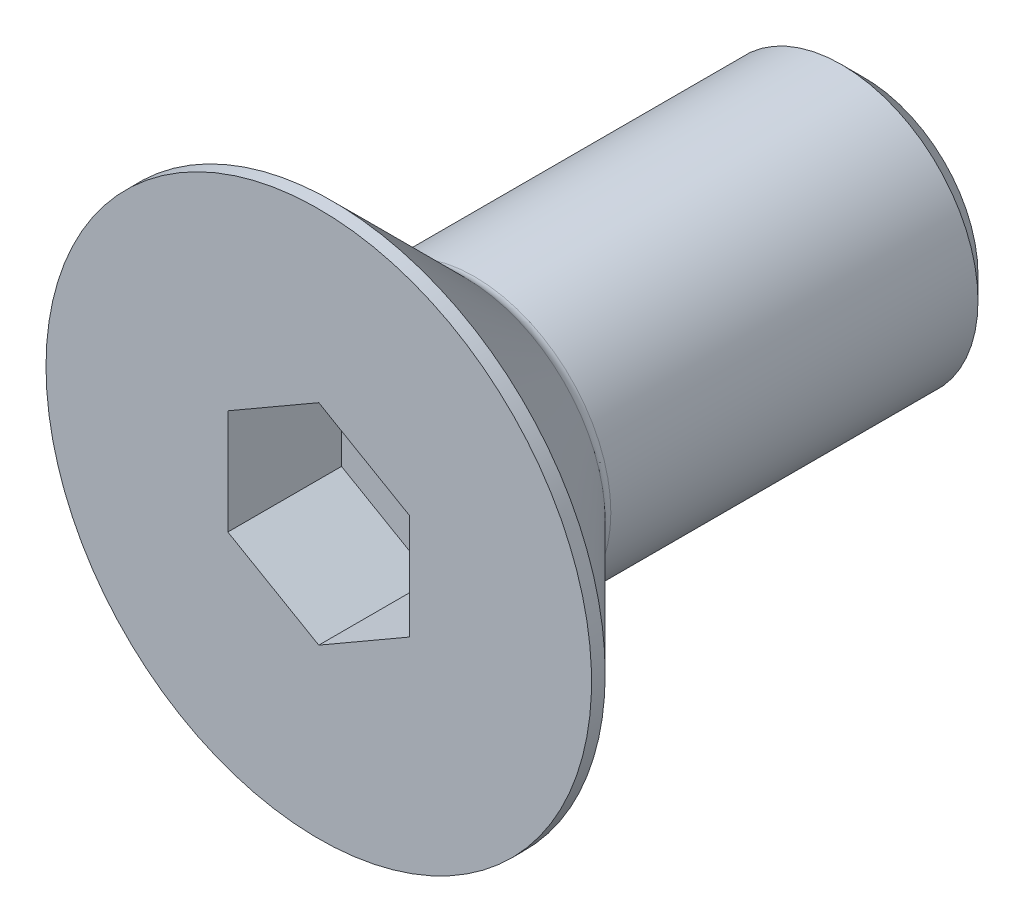
ISO-10303-21;
HEADER;
FILE_DESCRIPTION(('STEP AP214'),'2;1');
FILE_NAME('part.step','',(''),(''),'','','');
FILE_SCHEMA(('AUTOMOTIVE_DESIGN { 1 0 10303 214 1 1 1 1 }'));
ENDSEC;
DATA;
#1=APPLICATION_CONTEXT('core data for automotive mechanical design processes');
#2=APPLICATION_PROTOCOL_DEFINITION('international standard','automotive_design',2000,#1);
#3=PRODUCT_CONTEXT('',#1,'mechanical');
#4=PRODUCT('Part','Part','',(#3));
#5=PRODUCT_RELATED_PRODUCT_CATEGORY('part','',(#4));
#6=PRODUCT_DEFINITION_FORMATION('','',#4);
#7=PRODUCT_DEFINITION_CONTEXT('part definition',#1,'design');
#8=PRODUCT_DEFINITION('design','',#6,#7);
#9=PRODUCT_DEFINITION_SHAPE('','',#8);
#10=(LENGTH_UNIT() NAMED_UNIT(*) SI_UNIT(.MILLI.,.METRE.));
#11=(NAMED_UNIT(*) PLANE_ANGLE_UNIT() SI_UNIT($,.RADIAN.));
#12=(NAMED_UNIT(*) SI_UNIT($,.STERADIAN.) SOLID_ANGLE_UNIT());
#13=UNCERTAINTY_MEASURE_WITH_UNIT(LENGTH_MEASURE(1.E-05),#10,'distance_accuracy_value','');
#14=(GEOMETRIC_REPRESENTATION_CONTEXT(3) GLOBAL_UNCERTAINTY_ASSIGNED_CONTEXT((#13)) GLOBAL_UNIT_ASSIGNED_CONTEXT((#10,
#11,#12)) REPRESENTATION_CONTEXT('',''));
#15=CARTESIAN_POINT('',(0.,0.,0.));
#16=DIRECTION('',(0.,0.,1.));
#17=DIRECTION('',(1.,0.,0.));
#18=AXIS2_PLACEMENT_3D('',#15,#16,#17);
#19=CARTESIAN_POINT('',(0.,0.,-2.5));
#20=DIRECTION('',(0.,0.,1.));
#21=DIRECTION('',(1.,0.,0.));
#22=AXIS2_PLACEMENT_3D('',#19,#20,#21);
#23=PLANE('',#22);
#24=DIRECTION('',(-0.866025403784439,-0.5,0.));
#25=VECTOR('',#24,1.);
#26=CARTESIAN_POINT('',(0.,2.3094010767585,-2.5));
#27=LINE('',#26,#25);
#28=CARTESIAN_POINT('',(0.,2.3094010767585,-2.5));
#29=VERTEX_POINT('',#28);
#30=CARTESIAN_POINT('',(-2.,1.15470053837925,-2.5));
#31=VERTEX_POINT('',#30);
#32=EDGE_CURVE('E81',#29,#31,#27,.T.);
#33=ORIENTED_EDGE('',*,*,#32,.T.);
#34=DIRECTION('',(0.,1.,0.));
#35=VECTOR('',#34,1.);
#36=CARTESIAN_POINT('',(-2.,1.15470053837925,-2.5));
#37=LINE('',#36,#35);
#38=CARTESIAN_POINT('',(-2.,-1.15470053837925,-2.5));
#39=VERTEX_POINT('',#38);
#40=EDGE_CURVE('E65',#31,#39,#37,.F.);
#41=ORIENTED_EDGE('',*,*,#40,.T.);
#42=DIRECTION('',(0.866025403784439,-0.499999999999999,0.));
#43=VECTOR('',#42,1.);
#44=CARTESIAN_POINT('',(-2.,-1.15470053837925,-2.5));
#45=LINE('',#44,#43);
#46=CARTESIAN_POINT('',(0.,-2.3094010767585,-2.5));
#47=VERTEX_POINT('',#46);
#48=EDGE_CURVE('E70',#39,#47,#45,.T.);
#49=ORIENTED_EDGE('',*,*,#48,.T.);
#50=DIRECTION('',(0.866025403784439,0.5,0.));
#51=VECTOR('',#50,1.);
#52=CARTESIAN_POINT('',(0.,-2.3094010767585,-2.5));
#53=LINE('',#52,#51);
#54=CARTESIAN_POINT('',(2.,-1.15470053837925,-2.5));
#55=VERTEX_POINT('',#54);
#56=EDGE_CURVE('E127',#47,#55,#53,.T.);
#57=ORIENTED_EDGE('',*,*,#56,.T.);
#58=DIRECTION('',(0.,1.,0.));
#59=VECTOR('',#58,1.);
#60=CARTESIAN_POINT('',(2.,-1.15470053837925,-2.5));
#61=LINE('',#60,#59);
#62=CARTESIAN_POINT('',(2.,1.15470053837925,-2.5));
#63=VERTEX_POINT('',#62);
#64=EDGE_CURVE('E131',#55,#63,#61,.T.);
#65=ORIENTED_EDGE('',*,*,#64,.T.);
#66=DIRECTION('',(-0.866025403784439,0.499999999999999,0.));
#67=VECTOR('',#66,1.);
#68=CARTESIAN_POINT('',(2.,1.15470053837925,-2.5));
#69=LINE('',#68,#67);
#70=EDGE_CURVE('E136',#63,#29,#69,.T.);
#71=ORIENTED_EDGE('',*,*,#70,.T.);
#72=EDGE_LOOP('',(#33,#41,#49,#57,#65,#71));
#73=FACE_BOUND('',#72,.T.);
#74=ADVANCED_FACE('F14',(#73),#23,.T.);
#75=CARTESIAN_POINT('',(-2.,-1.15470053837925,0.));
#76=DIRECTION('',(-0.499999999999999,-0.866025403784439,0.));
#77=DIRECTION('',(0.866025403784439,-0.499999999999999,0.));
#78=AXIS2_PLACEMENT_3D('',#75,#76,#77);
#79=PLANE('',#78);
#80=DIRECTION('',(0.,0.,1.));
#81=VECTOR('',#80,1.);
#82=CARTESIAN_POINT('',(-2.,-1.15470053837925,0.));
#83=LINE('',#82,#81);
#84=CARTESIAN_POINT('',(-2.,-1.15470053837925,0.));
#85=VERTEX_POINT('',#84);
#86=EDGE_CURVE('E72',#39,#85,#83,.T.);
#87=ORIENTED_EDGE('',*,*,#86,.T.);
#88=DIRECTION('',(-0.866025403784439,0.499999999999999,0.));
#89=VECTOR('',#88,1.);
#90=CARTESIAN_POINT('',(0.,-2.3094010767585,0.));
#91=LINE('',#90,#89);
#92=CARTESIAN_POINT('',(0.,-2.3094010767585,0.));
#93=VERTEX_POINT('',#92);
#94=EDGE_CURVE('E125',#93,#85,#91,.T.);
#95=ORIENTED_EDGE('',*,*,#94,.F.);
#96=DIRECTION('',(0.,0.,1.));
#97=VECTOR('',#96,1.);
#98=CARTESIAN_POINT('',(0.,-2.3094010767585,0.));
#99=LINE('',#98,#97);
#100=EDGE_CURVE('E75',#93,#47,#99,.F.);
#101=ORIENTED_EDGE('',*,*,#100,.T.);
#102=ORIENTED_EDGE('',*,*,#48,.F.);
#103=EDGE_LOOP('',(#87,#95,#101,#102));
#104=FACE_BOUND('',#103,.T.);
#105=ADVANCED_FACE('F71',(#104),#79,.F.);
#106=CARTESIAN_POINT('',(-2.,1.15470053837925,0.));
#107=DIRECTION('',(-1.,0.,0.));
#108=DIRECTION('',(0.,0.,1.));
#109=AXIS2_PLACEMENT_3D('',#106,#107,#108);
#110=PLANE('',#109);
#111=DIRECTION('',(0.,0.,1.));
#112=VECTOR('',#111,1.);
#113=CARTESIAN_POINT('',(-2.,1.15470053837925,0.));
#114=LINE('',#113,#112);
#115=CARTESIAN_POINT('',(-2.,1.15470053837925,0.));
#116=VERTEX_POINT('',#115);
#117=EDGE_CURVE('E83',#31,#116,#114,.T.);
#118=ORIENTED_EDGE('',*,*,#117,.T.);
#119=DIRECTION('',(0.,1.,0.));
#120=VECTOR('',#119,1.);
#121=CARTESIAN_POINT('',(-2.,0.,0.));
#122=LINE('',#121,#120);
#123=EDGE_CURVE('E87',#85,#116,#122,.T.);
#124=ORIENTED_EDGE('',*,*,#123,.F.);
#125=ORIENTED_EDGE('',*,*,#86,.F.);
#126=ORIENTED_EDGE('',*,*,#40,.F.);
#127=EDGE_LOOP('',(#118,#124,#125,#126));
#128=FACE_BOUND('',#127,.T.);
#129=ADVANCED_FACE('F85',(#128),#110,.F.);
#130=CARTESIAN_POINT('',(0.,2.3094010767585,0.));
#131=DIRECTION('',(-0.5,0.866025403784439,0.));
#132=DIRECTION('',(-0.866025403784439,-0.5,0.));
#133=AXIS2_PLACEMENT_3D('',#130,#131,#132);
#134=PLANE('',#133);
#135=DIRECTION('',(0.,0.,1.));
#136=VECTOR('',#135,1.);
#137=CARTESIAN_POINT('',(0.,2.3094010767585,0.));
#138=LINE('',#137,#136);
#139=CARTESIAN_POINT('',(0.,2.3094010767585,0.));
#140=VERTEX_POINT('',#139);
#141=EDGE_CURVE('E138',#29,#140,#138,.T.);
#142=ORIENTED_EDGE('',*,*,#141,.T.);
#143=DIRECTION('',(0.866025403784439,0.5,0.));
#144=VECTOR('',#143,1.);
#145=CARTESIAN_POINT('',(-2.,1.15470053837925,0.));
#146=LINE('',#145,#144);
#147=EDGE_CURVE('E121',#116,#140,#146,.T.);
#148=ORIENTED_EDGE('',*,*,#147,.F.);
#149=ORIENTED_EDGE('',*,*,#117,.F.);
#150=ORIENTED_EDGE('',*,*,#32,.F.);
#151=EDGE_LOOP('',(#142,#148,#149,#150));
#152=FACE_BOUND('',#151,.T.);
#153=ADVANCED_FACE('F142',(#152),#134,.F.);
#154=CARTESIAN_POINT('',(2.,1.15470053837925,0.));
#155=DIRECTION('',(0.499999999999999,0.866025403784439,0.));
#156=DIRECTION('',(-0.866025403784439,0.499999999999999,0.));
#157=AXIS2_PLACEMENT_3D('',#154,#155,#156);
#158=PLANE('',#157);
#159=DIRECTION('',(0.,0.,-1.));
#160=VECTOR('',#159,1.);
#161=CARTESIAN_POINT('',(2.,1.15470053837925,0.));
#162=LINE('',#161,#160);
#163=CARTESIAN_POINT('',(2.,1.15470053837925,0.));
#164=VERTEX_POINT('',#163);
#165=EDGE_CURVE('E134',#63,#164,#162,.F.);
#166=ORIENTED_EDGE('',*,*,#165,.T.);
#167=DIRECTION('',(0.866025403784439,-0.499999999999999,0.));
#168=VECTOR('',#167,1.);
#169=CARTESIAN_POINT('',(0.,2.3094010767585,0.));
#170=LINE('',#169,#168);
#171=EDGE_CURVE('E118',#140,#164,#170,.T.);
#172=ORIENTED_EDGE('',*,*,#171,.F.);
#173=ORIENTED_EDGE('',*,*,#141,.F.);
#174=ORIENTED_EDGE('',*,*,#70,.F.);
#175=EDGE_LOOP('',(#166,#172,#173,#174));
#176=FACE_BOUND('',#175,.T.);
#177=ADVANCED_FACE('F153',(#176),#158,.F.);
#178=CARTESIAN_POINT('',(2.,-1.15470053837925,0.));
#179=DIRECTION('',(1.,0.,0.));
#180=DIRECTION('',(0.,0.,-1.));
#181=AXIS2_PLACEMENT_3D('',#178,#179,#180);
#182=PLANE('',#181);
#183=DIRECTION('',(0.,0.,1.));
#184=VECTOR('',#183,1.);
#185=CARTESIAN_POINT('',(2.,-1.15470053837925,0.));
#186=LINE('',#185,#184);
#187=CARTESIAN_POINT('',(2.,-1.15470053837925,0.));
#188=VERTEX_POINT('',#187);
#189=EDGE_CURVE('E33',#55,#188,#186,.T.);
#190=ORIENTED_EDGE('',*,*,#189,.T.);
#191=DIRECTION('',(0.,1.,0.));
#192=VECTOR('',#191,1.);
#193=CARTESIAN_POINT('',(2.,0.,0.));
#194=LINE('',#193,#192);
#195=EDGE_CURVE('E115',#164,#188,#194,.F.);
#196=ORIENTED_EDGE('',*,*,#195,.F.);
#197=ORIENTED_EDGE('',*,*,#165,.F.);
#198=ORIENTED_EDGE('',*,*,#64,.F.);
#199=EDGE_LOOP('',(#190,#196,#197,#198));
#200=FACE_BOUND('',#199,.T.);
#201=ADVANCED_FACE('F151',(#200),#182,.F.);
#202=CARTESIAN_POINT('',(0.,-2.3094010767585,0.));
#203=DIRECTION('',(0.5,-0.866025403784439,0.));
#204=DIRECTION('',(0.866025403784439,0.5,0.));
#205=AXIS2_PLACEMENT_3D('',#202,#203,#204);
#206=PLANE('',#205);
#207=ORIENTED_EDGE('',*,*,#100,.F.);
#208=DIRECTION('',(-0.866025403784439,-0.5,0.));
#209=VECTOR('',#208,1.);
#210=CARTESIAN_POINT('',(2.,-1.15470053837925,0.));
#211=LINE('',#210,#209);
#212=EDGE_CURVE('E112',#188,#93,#211,.T.);
#213=ORIENTED_EDGE('',*,*,#212,.F.);
#214=ORIENTED_EDGE('',*,*,#189,.F.);
#215=ORIENTED_EDGE('',*,*,#56,.F.);
#216=EDGE_LOOP('',(#207,#213,#214,#215));
#217=FACE_BOUND('',#216,.T.);
#218=ADVANCED_FACE('F149',(#217),#206,.F.);
#219=CARTESIAN_POINT('',(3.,0.,0.));
#220=DIRECTION('',(0.,0.,1.));
#221=DIRECTION('',(1.,0.,0.));
#222=AXIS2_PLACEMENT_3D('',#219,#220,#221);
#223=PLANE('',#222);
#224=ORIENTED_EDGE('',*,*,#195,.T.);
#225=ORIENTED_EDGE('',*,*,#212,.T.);
#226=ORIENTED_EDGE('',*,*,#94,.T.);
#227=ORIENTED_EDGE('',*,*,#123,.T.);
#228=ORIENTED_EDGE('',*,*,#147,.T.);
#229=ORIENTED_EDGE('',*,*,#171,.T.);
#230=EDGE_LOOP('',(#224,#225,#226,#227,#228,#229));
#231=FACE_BOUND('',#230,.T.);
#232=CARTESIAN_POINT('',(0.,0.,0.));
#233=DIRECTION('',(0.,0.,-1.));
#234=DIRECTION('',(-1.,0.,0.));
#235=AXIS2_PLACEMENT_3D('',#232,#233,#234);
#236=CIRCLE('',#235,6.);
#237=CARTESIAN_POINT('',(-6.,0.,0.));
#238=VERTEX_POINT('',#237);
#239=EDGE_CURVE('E18',#238,#238,#236,.T.);
#240=ORIENTED_EDGE('',*,*,#239,.F.);
#241=EDGE_LOOP('',(#240));
#242=FACE_BOUND('',#241,.T.);
#243=ADVANCED_FACE('F146',(#231,#242),#223,.T.);
#244=CARTESIAN_POINT('',(0.,0.,-0.150000000000001));
#245=DIRECTION('',(0.,0.,-1.));
#246=DIRECTION('',(-1.,0.,0.));
#247=AXIS2_PLACEMENT_3D('',#244,#245,#246);
#248=CYLINDRICAL_SURFACE('',#247,6.);
#249=ORIENTED_EDGE('',*,*,#239,.T.);
#250=EDGE_LOOP('',(#249));
#251=FACE_BOUND('',#250,.T.);
#252=CARTESIAN_POINT('',(0.,0.,-0.299999998617295));
#253=DIRECTION('',(0.,0.,1.));
#254=DIRECTION('',(1.,0.,0.));
#255=AXIS2_PLACEMENT_3D('',#252,#253,#254);
#256=CIRCLE('',#255,5.99999999872125);
#257=CARTESIAN_POINT('',(5.99999999872125,0.,-0.299999998617295));
#258=VERTEX_POINT('',#257);
#259=EDGE_CURVE('E99',#258,#258,#256,.F.);
#260=ORIENTED_EDGE('',*,*,#259,.F.);
#261=EDGE_LOOP('',(#260));
#262=FACE_BOUND('',#261,.T.);
#263=ADVANCED_FACE('F181',(#251,#262),#248,.T.);
#264=CARTESIAN_POINT('',(0.,0.,-0.299999998617295));
#265=DIRECTION('',(0.,0.,1.));
#266=DIRECTION('',(1.,0.,0.));
#267=AXIS2_PLACEMENT_3D('',#264,#265,#266);
#268=CONICAL_SURFACE('',#267,5.99999999872125,0.78539816249955);
#269=CARTESIAN_POINT('',(0.,0.,-3.21213203435596));
#270=DIRECTION('',(0.,0.,-1.));
#271=DIRECTION('',(0.,1.,0.));
#272=AXIS2_PLACEMENT_3D('',#269,#270,#271);
#273=CIRCLE('',#272,3.08786796564404);
#274=CARTESIAN_POINT('',(0.,3.08786796564404,-3.21213203435596));
#275=VERTEX_POINT('',#274);
#276=EDGE_CURVE('E93',#275,#275,#273,.T.);
#277=ORIENTED_EDGE('',*,*,#276,.F.);
#278=EDGE_LOOP('',(#277));
#279=FACE_BOUND('',#278,.T.);
#280=ORIENTED_EDGE('',*,*,#259,.T.);
#281=EDGE_LOOP('',(#280));
#282=FACE_BOUND('',#281,.T.);
#283=ADVANCED_FACE('F177',(#279,#282),#268,.T.);
#284=CARTESIAN_POINT('',(1.5,0.,-12.));
#285=DIRECTION('',(0.,0.,-1.));
#286=DIRECTION('',(-1.,0.,0.));
#287=AXIS2_PLACEMENT_3D('',#284,#285,#286);
#288=PLANE('',#287);
#289=CARTESIAN_POINT('',(0.,0.,-12.000000000171));
#290=DIRECTION('',(0.,0.,1.));
#291=DIRECTION('',(1.,0.,0.));
#292=AXIS2_PLACEMENT_3D('',#289,#290,#291);
#293=CIRCLE('',#292,2.5000000002251);
#294=CARTESIAN_POINT('',(2.5000000002251,0.,-12.000000000171));
#295=VERTEX_POINT('',#294);
#296=EDGE_CURVE('E91',#295,#295,#293,.T.);
#297=ORIENTED_EDGE('',*,*,#296,.F.);
#298=EDGE_LOOP('',(#297));
#299=FACE_BOUND('',#298,.T.);
#300=ADVANCED_FACE('F174',(#299),#288,.T.);
#301=CARTESIAN_POINT('',(0.,0.,-3.42426406871193));
#302=DIRECTION('',(0.,0.,-1.));
#303=DIRECTION('',(-1.,0.,0.));
#304=AXIS2_PLACEMENT_3D('',#301,#302,#303);
#305=TOROIDAL_SURFACE('',#304,3.3,0.3);
#306=CARTESIAN_POINT('',(0.,0.,-3.42426406871193));
#307=DIRECTION('',(0.,0.,-1.));
#308=DIRECTION('',(-1.,0.,0.));
#309=AXIS2_PLACEMENT_3D('',#306,#307,#308);
#310=CIRCLE('',#309,3.);
#311=CARTESIAN_POINT('',(-3.,0.,-3.42426406871193));
#312=VERTEX_POINT('',#311);
#313=EDGE_CURVE('E24',#312,#312,#310,.T.);
#314=ORIENTED_EDGE('',*,*,#313,.F.);
#315=EDGE_LOOP('',(#314));
#316=FACE_BOUND('',#315,.T.);
#317=ORIENTED_EDGE('',*,*,#276,.T.);
#318=EDGE_LOOP('',(#317));
#319=FACE_BOUND('',#318,.T.);
#320=ADVANCED_FACE('F16',(#316,#319),#305,.F.);
#321=CARTESIAN_POINT('',(0.,0.,-11.4999999997281));
#322=DIRECTION('',(0.,0.,1.));
#323=DIRECTION('',(1.,0.,0.));
#324=AXIS2_PLACEMENT_3D('',#321,#322,#323);
#325=CONICAL_SURFACE('',#324,2.99999999975853,0.785398162487954);
#326=ORIENTED_EDGE('',*,*,#296,.T.);
#327=EDGE_LOOP('',(#326));
#328=FACE_BOUND('',#327,.T.);
#329=CARTESIAN_POINT('',(0.,0.,-11.5));
#330=DIRECTION('',(0.,0.,-1.));
#331=DIRECTION('',(-1.,0.,0.));
#332=AXIS2_PLACEMENT_3D('',#329,#330,#331);
#333=CIRCLE('',#332,3.);
#334=CARTESIAN_POINT('',(-3.,0.,-11.5));
#335=VERTEX_POINT('',#334);
#336=EDGE_CURVE('E9',#335,#335,#333,.F.);
#337=ORIENTED_EDGE('',*,*,#336,.F.);
#338=EDGE_LOOP('',(#337));
#339=FACE_BOUND('',#338,.T.);
#340=ADVANCED_FACE('F165',(#328,#339),#325,.T.);
#341=CARTESIAN_POINT('',(0.,0.,-7.65));
#342=DIRECTION('',(0.,0.,-1.));
#343=DIRECTION('',(-1.,0.,0.));
#344=AXIS2_PLACEMENT_3D('',#341,#342,#343);
#345=CYLINDRICAL_SURFACE('',#344,3.);
#346=ORIENTED_EDGE('',*,*,#336,.T.);
#347=EDGE_LOOP('',(#346));
#348=FACE_BOUND('',#347,.T.);
#349=ORIENTED_EDGE('',*,*,#313,.T.);
#350=EDGE_LOOP('',(#349));
#351=FACE_BOUND('',#350,.T.);
#352=ADVANCED_FACE('F163',(#348,#351),#345,.T.);
#353=CLOSED_SHELL('',(#74,#105,#129,#153,#177,#201,#218,#243,#263,#283,#300,#320,#340,#352));
#354=MANIFOLD_SOLID_BREP('B1',#353);
#355=ADVANCED_BREP_SHAPE_REPRESENTATION('',(#18,#354),#14);
#356=SHAPE_DEFINITION_REPRESENTATION(#9,#355);
ENDSEC;
END-ISO-10303-21;
